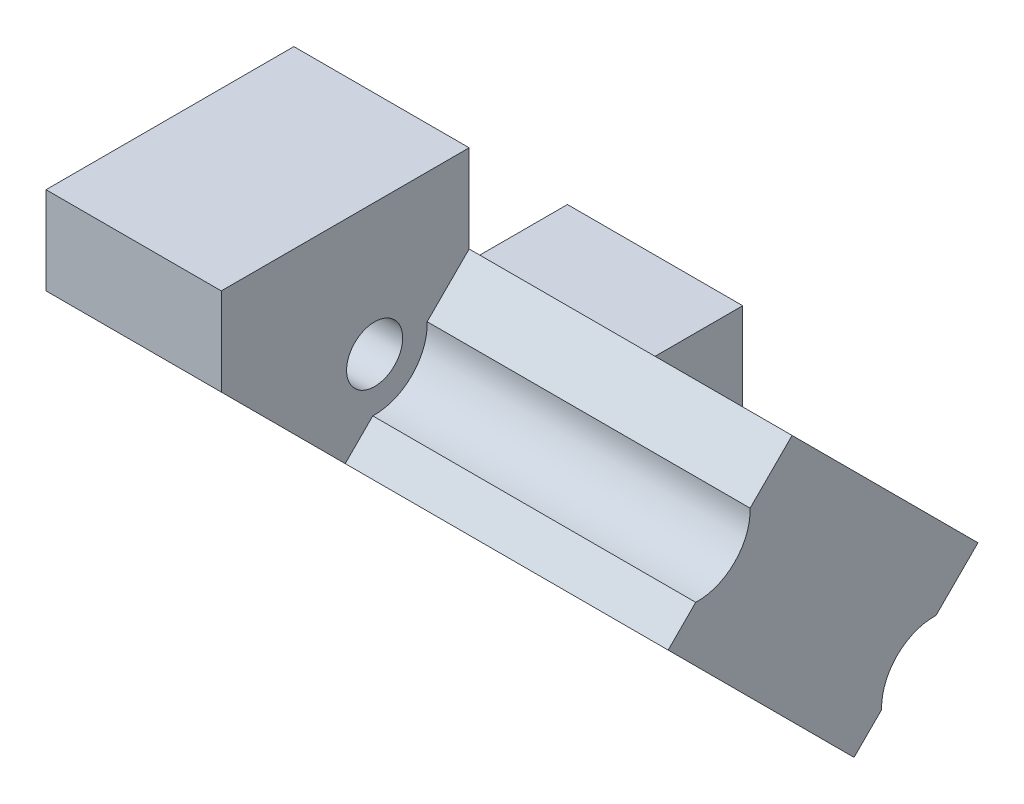
ISO-10303-21;
HEADER;
FILE_DESCRIPTION(('STEP AP214'),'2;1');
FILE_NAME('part.step','',(''),(''),'','','');
FILE_SCHEMA(('AUTOMOTIVE_DESIGN { 1 0 10303 214 1 1 1 1 }'));
ENDSEC;
DATA;
#1=APPLICATION_CONTEXT('core data for automotive mechanical design processes');
#2=APPLICATION_PROTOCOL_DEFINITION('international standard','automotive_design',2000,#1);
#3=PRODUCT_CONTEXT('',#1,'mechanical');
#4=PRODUCT('Part','Part','',(#3));
#5=PRODUCT_RELATED_PRODUCT_CATEGORY('part','',(#4));
#6=PRODUCT_DEFINITION_FORMATION('','',#4);
#7=PRODUCT_DEFINITION_CONTEXT('part definition',#1,'design');
#8=PRODUCT_DEFINITION('design','',#6,#7);
#9=PRODUCT_DEFINITION_SHAPE('','',#8);
#10=(LENGTH_UNIT() NAMED_UNIT(*) SI_UNIT(.MILLI.,.METRE.));
#11=(NAMED_UNIT(*) PLANE_ANGLE_UNIT() SI_UNIT($,.RADIAN.));
#12=(NAMED_UNIT(*) SI_UNIT($,.STERADIAN.) SOLID_ANGLE_UNIT());
#13=UNCERTAINTY_MEASURE_WITH_UNIT(LENGTH_MEASURE(1.E-05),#10,'distance_accuracy_value','');
#14=(GEOMETRIC_REPRESENTATION_CONTEXT(3) GLOBAL_UNCERTAINTY_ASSIGNED_CONTEXT((#13)) GLOBAL_UNIT_ASSIGNED_CONTEXT((#10,
#11,#12)) REPRESENTATION_CONTEXT('',''));
#15=CARTESIAN_POINT('',(0.,0.,0.));
#16=DIRECTION('',(0.,0.,1.));
#17=DIRECTION('',(1.,0.,0.));
#18=AXIS2_PLACEMENT_3D('',#15,#16,#17);
#19=CARTESIAN_POINT('',(-149.080786775194,-340.083953851921,525.27503979709));
#20=DIRECTION('',(0.,-0.707106781186548,0.707106781186547));
#21=DIRECTION('',(1.,0.,0.));
#22=AXIS2_PLACEMENT_3D('',#19,#20,#21);
#23=CONICAL_SURFACE('',#22,2.625,0.785398163397448);
#24=CARTESIAN_POINT('',(-149.080786775194,-339.11168202779,524.302767972959));
#25=DIRECTION('',(0.,-0.707106781186548,0.707106781186547));
#26=DIRECTION('',(-1.,0.,0.));
#27=AXIS2_PLACEMENT_3D('',#24,#25,#26);
#28=CIRCLE('',#27,1.25);
#29=CARTESIAN_POINT('',(-147.830786775194,-339.11168202779,524.302767972959));
#30=VERTEX_POINT('',#29);
#31=CARTESIAN_POINT('',(-150.330786775194,-339.11168202779,524.302767972959));
#32=VERTEX_POINT('',#31);
#33=EDGE_CURVE('E27',#30,#32,#28,.T.);
#34=ORIENTED_EDGE('',*,*,#33,.F.);
#35=CARTESIAN_POINT('',(-149.080786775194,-339.11168202779,524.302767972959));
#36=DIRECTION('',(0.,-0.707106781186548,0.707106781186547));
#37=DIRECTION('',(-1.,0.,0.));
#38=AXIS2_PLACEMENT_3D('',#35,#36,#37);
#39=CIRCLE('',#38,1.25);
#40=EDGE_CURVE('E381',#32,#30,#39,.T.);
#41=ORIENTED_EDGE('',*,*,#40,.F.);
#42=DIRECTION('',(-0.707106781186527,-0.499999999999999,0.50000000000003));
#43=VECTOR('',#42,1.);
#44=CARTESIAN_POINT('',(-151.705786775194,-340.083953851921,525.27503979709));
#45=LINE('',#44,#43);
#46=CARTESIAN_POINT('',(-153.080786775194,-341.056225676053,526.247311621222));
#47=VERTEX_POINT('',#46);
#48=EDGE_CURVE('E11',#32,#47,#45,.T.);
#49=ORIENTED_EDGE('',*,*,#48,.T.);
#50=CARTESIAN_POINT('',(-149.080786775194,-341.056225676053,526.247311621222));
#51=DIRECTION('',(0.,0.707106781186548,-0.707106781186547));
#52=DIRECTION('',(1.,0.,0.));
#53=AXIS2_PLACEMENT_3D('',#50,#51,#52);
#54=CIRCLE('',#53,4.);
#55=CARTESIAN_POINT('',(-145.080786775194,-341.056225676053,526.247311621221));
#56=VERTEX_POINT('',#55);
#57=EDGE_CURVE('E373',#56,#47,#54,.T.);
#58=ORIENTED_EDGE('',*,*,#57,.F.);
#59=CARTESIAN_POINT('',(-149.080786775194,-341.056225676053,526.247311621222));
#60=DIRECTION('',(0.,0.707106781186548,-0.707106781186547));
#61=DIRECTION('',(1.,0.,0.));
#62=AXIS2_PLACEMENT_3D('',#59,#60,#61);
#63=CIRCLE('',#62,4.);
#64=EDGE_CURVE('E377',#47,#56,#63,.T.);
#65=ORIENTED_EDGE('',*,*,#64,.F.);
#66=ORIENTED_EDGE('',*,*,#48,.F.);
#67=EDGE_LOOP('',(#34,#41,#49,#58,#65,#66));
#68=FACE_BOUND('',#67,.T.);
#69=ADVANCED_FACE('F16',(#68),#23,.F.);
#70=CARTESIAN_POINT('',(-149.080786775194,-337.52069177012,522.711777715289));
#71=DIRECTION('',(0.,-0.707106781186548,0.707106781186547));
#72=DIRECTION('',(1.,0.,0.));
#73=AXIS2_PLACEMENT_3D('',#70,#71,#72);
#74=CYLINDRICAL_SURFACE('',#73,1.25);
#75=CARTESIAN_POINT('',(-149.080786775194,-335.92970151245,521.120787457619));
#76=DIRECTION('',(0.,-0.707106781186548,0.707106781186547));
#77=DIRECTION('',(-1.,0.,0.));
#78=AXIS2_PLACEMENT_3D('',#75,#76,#77);
#79=CIRCLE('',#78,1.25);
#80=CARTESIAN_POINT('',(-147.830786775194,-335.92970151245,521.120787457619));
#81=VERTEX_POINT('',#80);
#82=CARTESIAN_POINT('',(-150.330786775194,-335.92970151245,521.120787457619));
#83=VERTEX_POINT('',#82);
#84=EDGE_CURVE('E348',#81,#83,#79,.T.);
#85=ORIENTED_EDGE('',*,*,#84,.F.);
#86=CARTESIAN_POINT('',(-149.080786775194,-335.92970151245,521.120787457619));
#87=DIRECTION('',(0.,-0.707106781186548,0.707106781186547));
#88=DIRECTION('',(-1.,0.,0.));
#89=AXIS2_PLACEMENT_3D('',#86,#87,#88);
#90=CIRCLE('',#89,1.25);
#91=EDGE_CURVE('E352',#83,#81,#90,.T.);
#92=ORIENTED_EDGE('',*,*,#91,.F.);
#93=DIRECTION('',(0.,-0.707106781186548,0.707106781186547));
#94=VECTOR('',#93,1.);
#95=CARTESIAN_POINT('',(-150.330786775194,-337.52069177012,522.711777715289));
#96=LINE('',#95,#94);
#97=EDGE_CURVE('E351',#83,#32,#96,.T.);
#98=ORIENTED_EDGE('',*,*,#97,.T.);
#99=ORIENTED_EDGE('',*,*,#40,.T.);
#100=ORIENTED_EDGE('',*,*,#33,.T.);
#101=ORIENTED_EDGE('',*,*,#97,.F.);
#102=EDGE_LOOP('',(#85,#92,#98,#99,#100,#101));
#103=FACE_BOUND('',#102,.T.);
#104=ADVANCED_FACE('F622',(#103),#74,.F.);
#105=CARTESIAN_POINT('',(-149.080786775194,-334.957429688319,520.148515633488));
#106=DIRECTION('',(0.,0.707106781186548,-0.707106781186547));
#107=DIRECTION('',(1.,0.,0.));
#108=AXIS2_PLACEMENT_3D('',#105,#106,#107);
#109=CONICAL_SURFACE('',#108,2.625,0.785398163397448);
#110=CARTESIAN_POINT('',(-149.080786775194,-333.985157864187,519.176243809356));
#111=DIRECTION('',(0.,-0.707106781186548,0.707106781186547));
#112=DIRECTION('',(1.,0.,0.));
#113=AXIS2_PLACEMENT_3D('',#110,#111,#112);
#114=CIRCLE('',#113,4.);
#115=CARTESIAN_POINT('',(-145.080786775194,-333.985157864187,519.176243809356));
#116=VERTEX_POINT('',#115);
#117=CARTESIAN_POINT('',(-153.080786775194,-333.985157864187,519.176243809356));
#118=VERTEX_POINT('',#117);
#119=EDGE_CURVE('E293',#116,#118,#114,.T.);
#120=ORIENTED_EDGE('',*,*,#119,.F.);
#121=CARTESIAN_POINT('',(-149.080786775194,-333.985157864187,519.176243809356));
#122=DIRECTION('',(0.,-0.707106781186548,0.707106781186547));
#123=DIRECTION('',(1.,0.,0.));
#124=AXIS2_PLACEMENT_3D('',#121,#122,#123);
#125=CIRCLE('',#124,4.);
#126=EDGE_CURVE('E287',#118,#116,#125,.T.);
#127=ORIENTED_EDGE('',*,*,#126,.F.);
#128=DIRECTION('',(0.707106781186567,-0.500000000000003,0.49999999999997));
#129=VECTOR('',#128,1.);
#130=CARTESIAN_POINT('',(-151.705786775194,-334.957429688319,520.148515633488));
#131=LINE('',#130,#129);
#132=EDGE_CURVE('E443',#118,#83,#131,.T.);
#133=ORIENTED_EDGE('',*,*,#132,.T.);
#134=ORIENTED_EDGE('',*,*,#91,.T.);
#135=ORIENTED_EDGE('',*,*,#84,.T.);
#136=ORIENTED_EDGE('',*,*,#132,.F.);
#137=EDGE_LOOP('',(#120,#127,#133,#134,#135,#136));
#138=FACE_BOUND('',#137,.T.);
#139=ADVANCED_FACE('F626',(#138),#109,.F.);
#140=CARTESIAN_POINT('',(-161.504786775194,-342.554127840182,527.745213785352));
#141=DIRECTION('',(1.,0.,0.));
#142=DIRECTION('',(0.,-0.707106781186548,0.707106781186547));
#143=AXIS2_PLACEMENT_3D('',#140,#141,#142);
#144=PLANE('',#143);
#145=CARTESIAN_POINT('',(-161.504786775194,-331.181857005288,529.872942950458));
#146=DIRECTION('',(-1.,0.,0.));
#147=DIRECTION('',(0.,0.707106781186547,0.707106781186548));
#148=AXIS2_PLACEMENT_3D('',#145,#146,#147);
#149=CIRCLE('',#148,1.6);
#150=CARTESIAN_POINT('',(-161.504786775193,-330.05048615539,531.004313800356));
#151=VERTEX_POINT('',#150);
#152=CARTESIAN_POINT('',(-161.504786775194,-332.313227855187,528.741572100559));
#153=VERTEX_POINT('',#152);
#154=EDGE_CURVE('E347',#151,#153,#149,.T.);
#155=ORIENTED_EDGE('',*,*,#154,.T.);
#156=CARTESIAN_POINT('',(-161.504786775194,-331.181857005288,529.872942950458));
#157=DIRECTION('',(-1.,0.,0.));
#158=DIRECTION('',(0.,0.707106781186547,0.707106781186548));
#159=AXIS2_PLACEMENT_3D('',#156,#157,#158);
#160=CIRCLE('',#159,1.6);
#161=EDGE_CURVE('E399',#153,#151,#160,.T.);
#162=ORIENTED_EDGE('',*,*,#161,.T.);
#163=EDGE_LOOP('',(#155,#162));
#164=FACE_BOUND('',#163,.T.);
#165=DIRECTION('',(0.,-0.707106781186547,-0.707106781186548));
#166=VECTOR('',#165,1.);
#167=CARTESIAN_POINT('',(-161.504786775193,-329.025907990247,538.277629307028));
#168=LINE('',#167,#166);
#169=CARTESIAN_POINT('',(-161.504786775193,-328.681857005288,538.621680291987));
#170=VERTEX_POINT('',#169);
#171=CARTESIAN_POINT('',(-161.504786775193,-335.752924817154,531.550612480121));
#172=VERTEX_POINT('',#171);
#173=EDGE_CURVE('E152',#170,#172,#168,.T.);
#174=ORIENTED_EDGE('',*,*,#173,.T.);
#175=DIRECTION('',(0.,-0.707106781186548,0.707106781186547));
#176=VECTOR('',#175,1.);
#177=CARTESIAN_POINT('',(-161.504786775194,-332.966341993286,528.764029656253));
#178=LINE('',#177,#176);
#179=CARTESIAN_POINT('',(-161.504786775194,-334.180026930883,529.977714593851));
#180=VERTEX_POINT('',#179);
#181=EDGE_CURVE('E392',#180,#172,#178,.T.);
#182=ORIENTED_EDGE('',*,*,#181,.F.);
#183=CARTESIAN_POINT('',(-161.504786775194,-331.181857005288,529.872942950458));
#184=DIRECTION('',(-1.,0.,0.));
#185=DIRECTION('',(0.,-0.707106781186547,-0.707106781186548));
#186=AXIS2_PLACEMENT_3D('',#183,#184,#185);
#187=CIRCLE('',#186,3.);
#188=CARTESIAN_POINT('',(-161.504786775194,-331.077085361895,526.874773024863));
#189=VERTEX_POINT('',#188);
#190=EDGE_CURVE('E323',#189,#180,#187,.T.);
#191=ORIENTED_EDGE('',*,*,#190,.F.);
#192=DIRECTION('',(0.,-0.707106781186548,0.707106781186547));
#193=VECTOR('',#192,1.);
#194=CARTESIAN_POINT('',(-161.504786775194,-332.966341993286,528.764029656253));
#195=LINE('',#194,#193);
#196=CARTESIAN_POINT('',(-161.504786775194,-328.681857005288,524.479544668256));
#197=VERTEX_POINT('',#196);
#198=EDGE_CURVE('E427',#197,#189,#195,.T.);
#199=ORIENTED_EDGE('',*,*,#198,.F.);
#200=DIRECTION('',(0.,1.,0.));
#201=VECTOR('',#200,1.);
#202=CARTESIAN_POINT('',(-161.504786775194,-328.681857005288,524.479544668256));
#203=LINE('',#202,#201);
#204=CARTESIAN_POINT('',(-161.504786775194,-323.681857005288,524.479544668256));
#205=VERTEX_POINT('',#204);
#206=EDGE_CURVE('E272',#197,#205,#203,.T.);
#207=ORIENTED_EDGE('',*,*,#206,.T.);
#208=DIRECTION('',(0.,0.,1.));
#209=VECTOR('',#208,1.);
#210=CARTESIAN_POINT('',(-161.504786775194,-323.681857005288,524.479544668256));
#211=LINE('',#210,#209);
#212=CARTESIAN_POINT('',(-161.504786775193,-323.681857005288,538.621680291987));
#213=VERTEX_POINT('',#212);
#214=EDGE_CURVE('E306',#205,#213,#211,.T.);
#215=ORIENTED_EDGE('',*,*,#214,.T.);
#216=DIRECTION('',(0.,-1.,0.));
#217=VECTOR('',#216,1.);
#218=CARTESIAN_POINT('',(-161.504786775193,-323.681857005288,538.621680291987));
#219=LINE('',#218,#217);
#220=EDGE_CURVE('E307',#213,#170,#219,.T.);
#221=ORIENTED_EDGE('',*,*,#220,.T.);
#222=EDGE_LOOP('',(#174,#182,#191,#199,#207,#215,#221));
#223=FACE_BOUND('',#222,.T.);
#224=ADVANCED_FACE('F577',(#164,#223),#144,.T.);
#225=CARTESIAN_POINT('',(-165.504786775194,-328.681857005288,524.479544668256));
#226=DIRECTION('',(-1.,0.,0.));
#227=DIRECTION('',(0.,-0.707106781186547,-0.707106781186548));
#228=AXIS2_PLACEMENT_3D('',#225,#226,#227);
#229=PLANE('',#228);
#230=CARTESIAN_POINT('',(-165.504786775194,-331.181857005288,529.872942950458));
#231=DIRECTION('',(1.,0.,0.));
#232=DIRECTION('',(0.,0.707106781186547,0.707106781186548));
#233=AXIS2_PLACEMENT_3D('',#230,#231,#232);
#234=CIRCLE('',#233,1.6);
#235=CARTESIAN_POINT('',(-165.504786775194,-332.313227855187,528.741572100559));
#236=VERTEX_POINT('',#235);
#237=EDGE_CURVE('E419',#236,#236,#234,.T.);
#238=ORIENTED_EDGE('',*,*,#237,.T.);
#239=EDGE_LOOP('',(#238));
#240=FACE_BOUND('',#239,.T.);
#241=CARTESIAN_POINT('',(-165.504786775194,-344.681857005288,516.372942950458));
#242=DIRECTION('',(1.,0.,0.));
#243=DIRECTION('',(0.,0.707106781186547,0.707106781186548));
#244=AXIS2_PLACEMENT_3D('',#241,#242,#243);
#245=CIRCLE('',#244,1.6);
#246=CARTESIAN_POINT('',(-165.504786775194,-345.813227855187,515.241572100559));
#247=VERTEX_POINT('',#246);
#248=EDGE_CURVE('E344',#247,#247,#245,.T.);
#249=ORIENTED_EDGE('',*,*,#248,.T.);
#250=EDGE_LOOP('',(#249));
#251=FACE_BOUND('',#250,.T.);
#252=DIRECTION('',(0.,0.707106781186547,0.707106781186548));
#253=VECTOR('',#252,1.);
#254=CARTESIAN_POINT('',(-165.504786775193,-326.374257560798,540.929279736477));
#255=LINE('',#254,#253);
#256=CARTESIAN_POINT('',(-165.504786775194,-353.430594346817,513.872942950458));
#257=VERTEX_POINT('',#256);
#258=CARTESIAN_POINT('',(-165.504786775193,-328.681857005288,538.621680291987));
#259=VERTEX_POINT('',#258);
#260=EDGE_CURVE('E254',#257,#259,#255,.T.);
#261=ORIENTED_EDGE('',*,*,#260,.T.);
#262=DIRECTION('',(0.,0.,-1.));
#263=VECTOR('',#262,1.);
#264=CARTESIAN_POINT('',(-165.504786775193,-328.681857005288,539.479544668256));
#265=LINE('',#264,#263);
#266=CARTESIAN_POINT('',(-165.504786775194,-328.681857005288,524.479544668256));
#267=VERTEX_POINT('',#266);
#268=EDGE_CURVE('E258',#259,#267,#265,.T.);
#269=ORIENTED_EDGE('',*,*,#268,.T.);
#270=DIRECTION('',(0.,0.707106781186547,0.707106781186548));
#271=VECTOR('',#270,1.);
#272=CARTESIAN_POINT('',(-165.504786775194,-339.288458723086,513.872942950458));
#273=LINE('',#272,#271);
#274=CARTESIAN_POINT('',(-165.504786775194,-339.288458723086,513.872942950458));
#275=VERTEX_POINT('',#274);
#276=EDGE_CURVE('E354',#275,#267,#273,.T.);
#277=ORIENTED_EDGE('',*,*,#276,.F.);
#278=DIRECTION('',(0.,-1.,0.));
#279=VECTOR('',#278,1.);
#280=CARTESIAN_POINT('',(-165.504786775194,-339.288458723086,513.872942950458));
#281=LINE('',#280,#279);
#282=EDGE_CURVE('E261',#275,#257,#281,.T.);
#283=ORIENTED_EDGE('',*,*,#282,.T.);
#284=EDGE_LOOP('',(#261,#269,#277,#283));
#285=FACE_BOUND('',#284,.T.);
#286=ADVANCED_FACE('F255',(#240,#251,#285),#229,.T.);
#287=CARTESIAN_POINT('',(-216.603281805474,-331.181857005288,529.87294295046));
#288=DIRECTION('',(1.,0.,0.));
#289=DIRECTION('',(0.,0.707106781186547,0.707106781186548));
#290=AXIS2_PLACEMENT_3D('',#287,#288,#289);
#291=CYLINDRICAL_SURFACE('',#290,1.6);
#292=ORIENTED_EDGE('',*,*,#154,.F.);
#293=ORIENTED_EDGE('',*,*,#161,.F.);
#294=DIRECTION('',(-1.,0.,0.));
#295=VECTOR('',#294,1.);
#296=CARTESIAN_POINT('',(-216.603281805474,-332.313227855186,528.741572100561));
#297=LINE('',#296,#295);
#298=EDGE_CURVE('E402',#153,#236,#297,.T.);
#299=ORIENTED_EDGE('',*,*,#298,.T.);
#300=ORIENTED_EDGE('',*,*,#237,.F.);
#301=ORIENTED_EDGE('',*,*,#298,.F.);
#302=EDGE_LOOP('',(#292,#293,#299,#300,#301));
#303=FACE_BOUND('',#302,.T.);
#304=ADVANCED_FACE('F652',(#303),#291,.F.);
#305=CARTESIAN_POINT('',(-216.603281805475,-344.681857005288,516.37294295046));
#306=DIRECTION('',(1.,0.,0.));
#307=DIRECTION('',(0.,0.707106781186547,0.707106781186548));
#308=AXIS2_PLACEMENT_3D('',#305,#306,#307);
#309=CYLINDRICAL_SURFACE('',#308,1.6);
#310=CARTESIAN_POINT('',(-161.504786775194,-344.681857005288,516.372942950458));
#311=DIRECTION('',(-1.,0.,0.));
#312=DIRECTION('',(0.,0.707106781186547,0.707106781186548));
#313=AXIS2_PLACEMENT_3D('',#310,#311,#312);
#314=CIRCLE('',#313,1.6);
#315=CARTESIAN_POINT('',(-161.504786775194,-343.55048615539,517.504313800356));
#316=VERTEX_POINT('',#315);
#317=CARTESIAN_POINT('',(-161.504786775194,-345.813227855187,515.241572100559));
#318=VERTEX_POINT('',#317);
#319=EDGE_CURVE('E498',#316,#318,#314,.T.);
#320=ORIENTED_EDGE('',*,*,#319,.F.);
#321=CARTESIAN_POINT('',(-161.504786775194,-344.681857005288,516.372942950458));
#322=DIRECTION('',(-1.,0.,0.));
#323=DIRECTION('',(0.,0.707106781186547,0.707106781186548));
#324=AXIS2_PLACEMENT_3D('',#321,#322,#323);
#325=CIRCLE('',#324,1.6);
#326=EDGE_CURVE('E430',#318,#316,#325,.T.);
#327=ORIENTED_EDGE('',*,*,#326,.F.);
#328=DIRECTION('',(-1.,0.,0.));
#329=VECTOR('',#328,1.);
#330=CARTESIAN_POINT('',(-216.603281805475,-345.813227855186,515.241572100561));
#331=LINE('',#330,#329);
#332=EDGE_CURVE('E20',#318,#247,#331,.T.);
#333=ORIENTED_EDGE('',*,*,#332,.T.);
#334=ORIENTED_EDGE('',*,*,#248,.F.);
#335=ORIENTED_EDGE('',*,*,#332,.F.);
#336=EDGE_LOOP('',(#320,#327,#333,#334,#335));
#337=FACE_BOUND('',#336,.T.);
#338=ADVANCED_FACE('F649',(#337),#309,.F.);
#339=CARTESIAN_POINT('',(-135.504786775194,-328.681857005288,524.479544668255));
#340=DIRECTION('',(0.,0.707106781186547,0.707106781186548));
#341=DIRECTION('',(-1.,0.,0.));
#342=AXIS2_PLACEMENT_3D('',#339,#340,#341);
#343=PLANE('',#342);
#344=DIRECTION('',(0.,0.707106781186548,-0.707106781186547));
#345=VECTOR('',#344,1.);
#346=CARTESIAN_POINT('',(-143.080786775194,-332.217390911221,528.015078574188));
#347=LINE('',#346,#345);
#348=CARTESIAN_POINT('',(-143.080786775194,-331.077085361895,526.874773024862));
#349=VERTEX_POINT('',#348);
#350=CARTESIAN_POINT('',(-143.080786775194,-328.681857005288,524.479544668255));
#351=VERTEX_POINT('',#350);
#352=EDGE_CURVE('E335',#349,#351,#347,.T.);
#353=ORIENTED_EDGE('',*,*,#352,.T.);
#354=DIRECTION('',(1.,0.,0.));
#355=VECTOR('',#354,1.);
#356=CARTESIAN_POINT('',(-165.504786775194,-328.681857005288,524.479544668256));
#357=LINE('',#356,#355);
#358=EDGE_CURVE('E385',#197,#351,#357,.T.);
#359=ORIENTED_EDGE('',*,*,#358,.F.);
#360=ORIENTED_EDGE('',*,*,#198,.T.);
#361=DIRECTION('',(1.,0.,0.));
#362=VECTOR('',#361,1.);
#363=CARTESIAN_POINT('',(-135.504786775194,-331.077085361895,526.874773024862));
#364=LINE('',#363,#362);
#365=EDGE_CURVE('E328',#189,#349,#364,.T.);
#366=ORIENTED_EDGE('',*,*,#365,.T.);
#367=EDGE_LOOP('',(#353,#359,#360,#366));
#368=FACE_BOUND('',#367,.T.);
#369=ADVANCED_FACE('F559',(#368),#343,.T.);
#370=CARTESIAN_POINT('',(-161.504786775194,-342.554127840182,527.745213785352));
#371=DIRECTION('',(1.,0.,0.));
#372=DIRECTION('',(0.,-0.707106781186548,0.707106781186547));
#373=AXIS2_PLACEMENT_3D('',#370,#371,#372);
#374=PLANE('',#373);
#375=ORIENTED_EDGE('',*,*,#319,.T.);
#376=ORIENTED_EDGE('',*,*,#326,.T.);
#377=EDGE_LOOP('',(#375,#376));
#378=FACE_BOUND('',#377,.T.);
#379=DIRECTION('',(0.,0.707106781186548,-0.707106781186547));
#380=VECTOR('',#379,1.);
#381=CARTESIAN_POINT('',(-161.504786775194,-343.572943711084,518.157427938455));
#382=LINE('',#381,#380);
#383=CARTESIAN_POINT('',(-161.504786775194,-341.683687079693,516.268171307065));
#384=VERTEX_POINT('',#383);
#385=CARTESIAN_POINT('',(-161.504786775194,-339.288458723086,513.872942950458));
#386=VERTEX_POINT('',#385);
#387=EDGE_CURVE('E327',#384,#386,#382,.T.);
#388=ORIENTED_EDGE('',*,*,#387,.F.);
#389=CARTESIAN_POINT('',(-161.504786775194,-344.681857005288,516.372942950458));
#390=DIRECTION('',(-1.,0.,0.));
#391=DIRECTION('',(0.,-0.707106781186547,-0.707106781186548));
#392=AXIS2_PLACEMENT_3D('',#389,#390,#391);
#393=CIRCLE('',#392,3.);
#394=CARTESIAN_POINT('',(-161.504786775194,-344.786628648681,519.371112876052));
#395=VERTEX_POINT('',#394);
#396=EDGE_CURVE('E527',#395,#384,#393,.T.);
#397=ORIENTED_EDGE('',*,*,#396,.F.);
#398=DIRECTION('',(0.,0.707106781186548,-0.707106781186547));
#399=VECTOR('',#398,1.);
#400=CARTESIAN_POINT('',(-161.504786775194,-343.572943711084,518.157427938455));
#401=LINE('',#400,#399);
#402=CARTESIAN_POINT('',(-161.504786775194,-346.359526534952,520.944010762323));
#403=VERTEX_POINT('',#402);
#404=EDGE_CURVE('E365',#403,#395,#401,.T.);
#405=ORIENTED_EDGE('',*,*,#404,.F.);
#406=DIRECTION('',(0.,-0.707106781186547,-0.707106781186548));
#407=VECTOR('',#406,1.);
#408=CARTESIAN_POINT('',(-161.504786775193,-329.025907990247,538.277629307028));
#409=LINE('',#408,#407);
#410=CARTESIAN_POINT('',(-161.504786775194,-353.430594346817,513.872942950458));
#411=VERTEX_POINT('',#410);
#412=EDGE_CURVE('E265',#403,#411,#409,.T.);
#413=ORIENTED_EDGE('',*,*,#412,.T.);
#414=DIRECTION('',(0.,0.,-1.));
#415=VECTOR('',#414,1.);
#416=CARTESIAN_POINT('',(-161.504786775194,-353.430594346817,513.872942950458));
#417=LINE('',#416,#415);
#418=CARTESIAN_POINT('',(-161.504786775194,-353.430594346817,508.872942950458));
#419=VERTEX_POINT('',#418);
#420=EDGE_CURVE('E333',#411,#419,#417,.T.);
#421=ORIENTED_EDGE('',*,*,#420,.T.);
#422=DIRECTION('',(0.,1.,0.));
#423=VECTOR('',#422,1.);
#424=CARTESIAN_POINT('',(-161.504786775194,-353.430594346817,508.872942950458));
#425=LINE('',#424,#423);
#426=CARTESIAN_POINT('',(-161.504786775194,-339.288458723086,508.872942950458));
#427=VERTEX_POINT('',#426);
#428=EDGE_CURVE('E321',#419,#427,#425,.T.);
#429=ORIENTED_EDGE('',*,*,#428,.T.);
#430=DIRECTION('',(0.,0.,1.));
#431=VECTOR('',#430,1.);
#432=CARTESIAN_POINT('',(-161.504786775194,-339.288458723086,508.872942950458));
#433=LINE('',#432,#431);
#434=EDGE_CURVE('E371',#427,#386,#433,.T.);
#435=ORIENTED_EDGE('',*,*,#434,.T.);
#436=EDGE_LOOP('',(#388,#397,#405,#413,#421,#429,#435));
#437=FACE_BOUND('',#436,.T.);
#438=ADVANCED_FACE('F591',(#378,#437),#374,.T.);
#439=CARTESIAN_POINT('',(-165.504786775194,-339.288458723086,513.872942950458));
#440=DIRECTION('',(0.,-0.707106781186547,-0.707106781186548));
#441=DIRECTION('',(0.,0.707106781186548,-0.707106781186547));
#442=AXIS2_PLACEMENT_3D('',#439,#440,#441);
#443=PLANE('',#442);
#444=DIRECTION('',(0.,-0.707106781186548,0.707106781186547));
#445=VECTOR('',#444,1.);
#446=CARTESIAN_POINT('',(-143.080786775194,-342.823992629019,517.40847685639));
#447=LINE('',#446,#445);
#448=CARTESIAN_POINT('',(-143.080786775194,-339.288458723086,513.872942950457));
#449=VERTEX_POINT('',#448);
#450=CARTESIAN_POINT('',(-143.080786775194,-341.683687079693,516.268171307064));
#451=VERTEX_POINT('',#450);
#452=EDGE_CURVE('E339',#449,#451,#447,.T.);
#453=ORIENTED_EDGE('',*,*,#452,.T.);
#454=DIRECTION('',(-1.,0.,0.));
#455=VECTOR('',#454,1.);
#456=CARTESIAN_POINT('',(-135.504786775194,-341.683687079693,516.268171307064));
#457=LINE('',#456,#455);
#458=EDGE_CURVE('E366',#451,#384,#457,.T.);
#459=ORIENTED_EDGE('',*,*,#458,.T.);
#460=ORIENTED_EDGE('',*,*,#387,.T.);
#461=DIRECTION('',(-1.,0.,0.));
#462=VECTOR('',#461,1.);
#463=CARTESIAN_POINT('',(-135.504786775194,-339.288458723086,513.872942950456));
#464=LINE('',#463,#462);
#465=EDGE_CURVE('E311',#449,#386,#464,.T.);
#466=ORIENTED_EDGE('',*,*,#465,.F.);
#467=EDGE_LOOP('',(#453,#459,#460,#466));
#468=FACE_BOUND('',#467,.T.);
#469=ADVANCED_FACE('F588',(#468),#443,.T.);
#470=CARTESIAN_POINT('',(-135.504786775194,-331.181857005288,529.872942950456));
#471=DIRECTION('',(-1.,0.,0.));
#472=DIRECTION('',(0.,-0.707106781186547,-0.707106781186548));
#473=AXIS2_PLACEMENT_3D('',#470,#471,#472);
#474=CYLINDRICAL_SURFACE('',#473,3.);
#475=CARTESIAN_POINT('',(-143.080786775194,-331.181857005288,529.872942950457));
#476=DIRECTION('',(1.,0.,0.));
#477=DIRECTION('',(0.,-0.707106781186547,-0.707106781186548));
#478=AXIS2_PLACEMENT_3D('',#475,#476,#477);
#479=CIRCLE('',#478,3.);
#480=CARTESIAN_POINT('',(-143.080786775194,-334.180026930883,529.97771459385));
#481=VERTEX_POINT('',#480);
#482=EDGE_CURVE('E338',#481,#349,#479,.T.);
#483=ORIENTED_EDGE('',*,*,#482,.T.);
#484=ORIENTED_EDGE('',*,*,#365,.F.);
#485=ORIENTED_EDGE('',*,*,#190,.T.);
#486=DIRECTION('',(-1.,0.,0.));
#487=VECTOR('',#486,1.);
#488=CARTESIAN_POINT('',(-135.504786775194,-334.180026930883,529.977714593849));
#489=LINE('',#488,#487);
#490=EDGE_CURVE('E388',#481,#180,#489,.T.);
#491=ORIENTED_EDGE('',*,*,#490,.F.);
#492=EDGE_LOOP('',(#483,#484,#485,#491));
#493=FACE_BOUND('',#492,.T.);
#494=ADVANCED_FACE('F576',(#493),#474,.F.);
#495=CARTESIAN_POINT('',(-135.504786775194,-328.681857005288,524.479544668255));
#496=DIRECTION('',(0.,0.707106781186547,0.707106781186548));
#497=DIRECTION('',(-1.,0.,0.));
#498=AXIS2_PLACEMENT_3D('',#495,#496,#497);
#499=PLANE('',#498);
#500=DIRECTION('',(0.,0.707106781186548,-0.707106781186547));
#501=VECTOR('',#500,1.);
#502=CARTESIAN_POINT('',(-143.080786775194,-332.217390911221,528.015078574188));
#503=LINE('',#502,#501);
#504=CARTESIAN_POINT('',(-143.080786775193,-335.752924817154,531.55061248012));
#505=VERTEX_POINT('',#504);
#506=EDGE_CURVE('E398',#505,#481,#503,.T.);
#507=ORIENTED_EDGE('',*,*,#506,.T.);
#508=ORIENTED_EDGE('',*,*,#490,.T.);
#509=ORIENTED_EDGE('',*,*,#181,.T.);
#510=DIRECTION('',(-1.,0.,0.));
#511=VECTOR('',#510,1.);
#512=CARTESIAN_POINT('',(-165.504786775193,-335.752924817154,531.550612480121));
#513=LINE('',#512,#511);
#514=EDGE_CURVE('E469',#505,#172,#513,.T.);
#515=ORIENTED_EDGE('',*,*,#514,.F.);
#516=EDGE_LOOP('',(#507,#508,#509,#515));
#517=FACE_BOUND('',#516,.T.);
#518=ADVANCED_FACE('F579',(#517),#499,.T.);
#519=CARTESIAN_POINT('',(-150.504786775194,-341.056225676053,526.247311621222));
#520=DIRECTION('',(0.,-0.707106781186548,0.707106781186547));
#521=DIRECTION('',(-1.,0.,0.));
#522=AXIS2_PLACEMENT_3D('',#519,#520,#521);
#523=PLANE('',#522);
#524=ORIENTED_EDGE('',*,*,#57,.T.);
#525=ORIENTED_EDGE('',*,*,#64,.T.);
#526=EDGE_LOOP('',(#524,#525));
#527=FACE_BOUND('',#526,.T.);
#528=CARTESIAN_POINT('',(-157.504786775194,-341.056225676053,526.247311621222));
#529=DIRECTION('',(0.,0.707106781186548,-0.707106781186547));
#530=DIRECTION('',(-1.,0.,0.));
#531=AXIS2_PLACEMENT_3D('',#528,#529,#530);
#532=CIRCLE('',#531,0.95);
#533=CARTESIAN_POINT('',(-156.554786775194,-341.056225676053,526.247311621222));
#534=VERTEX_POINT('',#533);
#535=EDGE_CURVE('E343',#534,#534,#532,.T.);
#536=ORIENTED_EDGE('',*,*,#535,.T.);
#537=EDGE_LOOP('',(#536));
#538=FACE_BOUND('',#537,.T.);
#539=DIRECTION('',(0.,0.707106781186547,0.707106781186548));
#540=VECTOR('',#539,1.);
#541=CARTESIAN_POINT('',(-143.080786775194,-345.439361771408,521.864175525866));
#542=LINE('',#541,#540);
#543=CARTESIAN_POINT('',(-143.080786775194,-346.359526534952,520.944010762322));
#544=VERTEX_POINT('',#543);
#545=EDGE_CURVE('E475',#544,#505,#542,.T.);
#546=ORIENTED_EDGE('',*,*,#545,.T.);
#547=ORIENTED_EDGE('',*,*,#514,.T.);
#548=ORIENTED_EDGE('',*,*,#173,.F.);
#549=DIRECTION('',(1.,0.,0.));
#550=VECTOR('',#549,1.);
#551=CARTESIAN_POINT('',(-163.504786775193,-328.681857005288,538.621680291987));
#552=LINE('',#551,#550);
#553=EDGE_CURVE('E267',#259,#170,#552,.T.);
#554=ORIENTED_EDGE('',*,*,#553,.F.);
#555=ORIENTED_EDGE('',*,*,#260,.F.);
#556=DIRECTION('',(-1.,0.,0.));
#557=VECTOR('',#556,1.);
#558=CARTESIAN_POINT('',(-163.504786775194,-353.430594346817,513.872942950458));
#559=LINE('',#558,#557);
#560=EDGE_CURVE('E411',#411,#257,#559,.T.);
#561=ORIENTED_EDGE('',*,*,#560,.F.);
#562=ORIENTED_EDGE('',*,*,#412,.F.);
#563=DIRECTION('',(1.,0.,0.));
#564=VECTOR('',#563,1.);
#565=CARTESIAN_POINT('',(-160.504786775194,-346.359526534952,520.944010762323));
#566=LINE('',#565,#564);
#567=EDGE_CURVE('E362',#403,#544,#566,.T.);
#568=ORIENTED_EDGE('',*,*,#567,.T.);
#569=EDGE_LOOP('',(#546,#547,#548,#554,#555,#561,#562,#568));
#570=FACE_BOUND('',#569,.T.);
#571=ADVANCED_FACE('F269',(#527,#538,#570),#523,.T.);
#572=CARTESIAN_POINT('',(-165.504786775194,-339.288458723086,513.872942950458));
#573=DIRECTION('',(0.,-0.707106781186547,-0.707106781186548));
#574=DIRECTION('',(0.,0.707106781186548,-0.707106781186547));
#575=AXIS2_PLACEMENT_3D('',#572,#573,#574);
#576=PLANE('',#575);
#577=DIRECTION('',(0.,-0.707106781186548,0.707106781186547));
#578=VECTOR('',#577,1.);
#579=CARTESIAN_POINT('',(-143.080786775194,-342.823992629019,517.40847685639));
#580=LINE('',#579,#578);
#581=CARTESIAN_POINT('',(-143.080786775194,-344.786628648681,519.371112876051));
#582=VERTEX_POINT('',#581);
#583=EDGE_CURVE('E478',#582,#544,#580,.T.);
#584=ORIENTED_EDGE('',*,*,#583,.T.);
#585=ORIENTED_EDGE('',*,*,#567,.F.);
#586=ORIENTED_EDGE('',*,*,#404,.T.);
#587=DIRECTION('',(1.,0.,0.));
#588=VECTOR('',#587,1.);
#589=CARTESIAN_POINT('',(-135.504786775194,-344.786628648681,519.371112876051));
#590=LINE('',#589,#588);
#591=EDGE_CURVE('E485',#395,#582,#590,.T.);
#592=ORIENTED_EDGE('',*,*,#591,.T.);
#593=EDGE_LOOP('',(#584,#585,#586,#592));
#594=FACE_BOUND('',#593,.T.);
#595=ADVANCED_FACE('F606',(#594),#576,.T.);
#596=CARTESIAN_POINT('',(-135.504786775194,-344.681857005288,516.372942950456));
#597=DIRECTION('',(-1.,0.,0.));
#598=DIRECTION('',(0.,0.707106781186547,0.707106781186548));
#599=AXIS2_PLACEMENT_3D('',#596,#597,#598);
#600=CYLINDRICAL_SURFACE('',#599,3.);
#601=CARTESIAN_POINT('',(-143.080786775194,-344.681857005288,516.372942950457));
#602=DIRECTION('',(1.,0.,0.));
#603=DIRECTION('',(0.,-0.707106781186547,-0.707106781186548));
#604=AXIS2_PLACEMENT_3D('',#601,#602,#603);
#605=CIRCLE('',#604,3.);
#606=EDGE_CURVE('E481',#451,#582,#605,.T.);
#607=ORIENTED_EDGE('',*,*,#606,.T.);
#608=ORIENTED_EDGE('',*,*,#591,.F.);
#609=ORIENTED_EDGE('',*,*,#396,.T.);
#610=ORIENTED_EDGE('',*,*,#458,.F.);
#611=EDGE_LOOP('',(#607,#608,#609,#610));
#612=FACE_BOUND('',#611,.T.);
#613=ADVANCED_FACE('F608',(#612),#600,.F.);
#614=CARTESIAN_POINT('',(-143.080786775194,-349.822497866763,517.481039430511));
#615=DIRECTION('',(-1.,0.,0.));
#616=DIRECTION('',(0.,-0.707106781186548,0.707106781186547));
#617=AXIS2_PLACEMENT_3D('',#614,#615,#616);
#618=PLANE('',#617);
#619=ORIENTED_EDGE('',*,*,#452,.F.);
#620=DIRECTION('',(0.,-0.707106781186547,-0.707106781186548));
#621=VECTOR('',#620,1.);
#622=CARTESIAN_POINT('',(-143.080786775194,-338.368293959542,514.793107714001));
#623=LINE('',#622,#621);
#624=EDGE_CURVE('E316',#351,#449,#623,.T.);
#625=ORIENTED_EDGE('',*,*,#624,.F.);
#626=ORIENTED_EDGE('',*,*,#352,.F.);
#627=ORIENTED_EDGE('',*,*,#482,.F.);
#628=ORIENTED_EDGE('',*,*,#506,.F.);
#629=ORIENTED_EDGE('',*,*,#545,.F.);
#630=ORIENTED_EDGE('',*,*,#583,.F.);
#631=ORIENTED_EDGE('',*,*,#606,.F.);
#632=EDGE_LOOP('',(#619,#625,#626,#627,#628,#629,#630,#631));
#633=FACE_BOUND('',#632,.T.);
#634=ADVANCED_FACE('F584',(#633),#618,.F.);
#635=CARTESIAN_POINT('',(-171.504786775194,-346.359526534952,511.372942950458));
#636=DIRECTION('',(-1.,0.,0.));
#637=DIRECTION('',(0.,-0.707106781186547,-0.707106781186548));
#638=AXIS2_PLACEMENT_3D('',#635,#636,#637);
#639=PLANE('',#638);
#640=DIRECTION('',(0.,1.,0.));
#641=VECTOR('',#640,1.);
#642=CARTESIAN_POINT('',(-171.504786775194,-339.288458723086,513.872942950458));
#643=LINE('',#642,#641);
#644=CARTESIAN_POINT('',(-171.504786775194,-353.430594346817,513.872942950458));
#645=VERTEX_POINT('',#644);
#646=CARTESIAN_POINT('',(-171.504786775194,-339.288458723086,513.872942950458));
#647=VERTEX_POINT('',#646);
#648=EDGE_CURVE('E334',#645,#647,#643,.T.);
#649=ORIENTED_EDGE('',*,*,#648,.T.);
#650=DIRECTION('',(0.,0.,-1.));
#651=VECTOR('',#650,1.);
#652=CARTESIAN_POINT('',(-171.504786775194,-339.288458723086,508.872942950458));
#653=LINE('',#652,#651);
#654=CARTESIAN_POINT('',(-171.504786775194,-339.288458723086,508.872942950458));
#655=VERTEX_POINT('',#654);
#656=EDGE_CURVE('E461',#647,#655,#653,.T.);
#657=ORIENTED_EDGE('',*,*,#656,.T.);
#658=DIRECTION('',(0.,-1.,0.));
#659=VECTOR('',#658,1.);
#660=CARTESIAN_POINT('',(-171.504786775194,-353.430594346817,508.872942950458));
#661=LINE('',#660,#659);
#662=CARTESIAN_POINT('',(-171.504786775194,-353.430594346817,508.872942950458));
#663=VERTEX_POINT('',#662);
#664=EDGE_CURVE('E372',#655,#663,#661,.T.);
#665=ORIENTED_EDGE('',*,*,#664,.T.);
#666=DIRECTION('',(0.,0.,1.));
#667=VECTOR('',#666,1.);
#668=CARTESIAN_POINT('',(-171.504786775194,-353.430594346817,513.872942950458));
#669=LINE('',#668,#667);
#670=EDGE_CURVE('E322',#663,#645,#669,.T.);
#671=ORIENTED_EDGE('',*,*,#670,.T.);
#672=EDGE_LOOP('',(#649,#657,#665,#671));
#673=FACE_BOUND('',#672,.T.);
#674=ADVANCED_FACE('F616',(#673),#639,.T.);
#675=CARTESIAN_POINT('',(-161.504786775194,-339.288458723086,513.872942950458));
#676=DIRECTION('',(0.,1.,0.));
#677=DIRECTION('',(1.,0.,0.));
#678=AXIS2_PLACEMENT_3D('',#675,#676,#677);
#679=PLANE('',#678);
#680=ORIENTED_EDGE('',*,*,#434,.F.);
#681=DIRECTION('',(-1.,0.,0.));
#682=VECTOR('',#681,1.);
#683=CARTESIAN_POINT('',(-161.504786775194,-339.288458723086,508.872942950458));
#684=LINE('',#683,#682);
#685=EDGE_CURVE('E367',#427,#655,#684,.T.);
#686=ORIENTED_EDGE('',*,*,#685,.T.);
#687=ORIENTED_EDGE('',*,*,#656,.F.);
#688=DIRECTION('',(-1.,0.,0.));
#689=VECTOR('',#688,1.);
#690=CARTESIAN_POINT('',(-161.504786775194,-339.288458723086,513.872942950458));
#691=LINE('',#690,#689);
#692=EDGE_CURVE('E299',#275,#647,#691,.T.);
#693=ORIENTED_EDGE('',*,*,#692,.F.);
#694=DIRECTION('',(-1.,0.,0.));
#695=VECTOR('',#694,1.);
#696=CARTESIAN_POINT('',(-135.504786775194,-339.288458723086,513.872942950456));
#697=LINE('',#696,#695);
#698=EDGE_CURVE('E315',#386,#275,#697,.T.);
#699=ORIENTED_EDGE('',*,*,#698,.F.);
#700=EDGE_LOOP('',(#680,#686,#687,#693,#699));
#701=FACE_BOUND('',#700,.T.);
#702=ADVANCED_FACE('F594',(#701),#679,.T.);
#703=CARTESIAN_POINT('',(-161.504786775194,-339.288458723086,508.872942950458));
#704=DIRECTION('',(0.,0.,-1.));
#705=DIRECTION('',(0.,1.,0.));
#706=AXIS2_PLACEMENT_3D('',#703,#704,#705);
#707=PLANE('',#706);
#708=ORIENTED_EDGE('',*,*,#428,.F.);
#709=DIRECTION('',(-1.,0.,0.));
#710=VECTOR('',#709,1.);
#711=CARTESIAN_POINT('',(-161.504786775194,-353.430594346817,508.872942950458));
#712=LINE('',#711,#710);
#713=EDGE_CURVE('E317',#419,#663,#712,.T.);
#714=ORIENTED_EDGE('',*,*,#713,.T.);
#715=ORIENTED_EDGE('',*,*,#664,.F.);
#716=ORIENTED_EDGE('',*,*,#685,.F.);
#717=EDGE_LOOP('',(#708,#714,#715,#716));
#718=FACE_BOUND('',#717,.T.);
#719=ADVANCED_FACE('F636',(#718),#707,.T.);
#720=CARTESIAN_POINT('',(-161.504786775194,-353.430594346817,508.872942950458));
#721=DIRECTION('',(0.,-1.,0.));
#722=DIRECTION('',(1.,0.,0.));
#723=AXIS2_PLACEMENT_3D('',#720,#721,#722);
#724=PLANE('',#723);
#725=ORIENTED_EDGE('',*,*,#420,.F.);
#726=ORIENTED_EDGE('',*,*,#560,.T.);
#727=DIRECTION('',(-1.,0.,0.));
#728=VECTOR('',#727,1.);
#729=CARTESIAN_POINT('',(-161.504786775194,-353.430594346817,513.872942950458));
#730=LINE('',#729,#728);
#731=EDGE_CURVE('E329',#257,#645,#730,.T.);
#732=ORIENTED_EDGE('',*,*,#731,.T.);
#733=ORIENTED_EDGE('',*,*,#670,.F.);
#734=ORIENTED_EDGE('',*,*,#713,.F.);
#735=EDGE_LOOP('',(#725,#726,#732,#733,#734));
#736=FACE_BOUND('',#735,.T.);
#737=ADVANCED_FACE('F602',(#736),#724,.T.);
#738=CARTESIAN_POINT('',(-161.504786775194,-353.430594346817,513.872942950458));
#739=DIRECTION('',(0.,0.,1.));
#740=DIRECTION('',(-1.,0.,0.));
#741=AXIS2_PLACEMENT_3D('',#738,#739,#740);
#742=PLANE('',#741);
#743=ORIENTED_EDGE('',*,*,#282,.F.);
#744=ORIENTED_EDGE('',*,*,#692,.T.);
#745=ORIENTED_EDGE('',*,*,#648,.F.);
#746=ORIENTED_EDGE('',*,*,#731,.F.);
#747=EDGE_LOOP('',(#743,#744,#745,#746));
#748=FACE_BOUND('',#747,.T.);
#749=ADVANCED_FACE('F598',(#748),#742,.T.);
#750=CARTESIAN_POINT('',(-171.504786775193,-326.181857005288,531.550612480122));
#751=DIRECTION('',(-1.,0.,0.));
#752=DIRECTION('',(0.,-0.707106781186547,-0.707106781186548));
#753=AXIS2_PLACEMENT_3D('',#750,#751,#752);
#754=PLANE('',#753);
#755=DIRECTION('',(0.,-1.,0.));
#756=VECTOR('',#755,1.);
#757=CARTESIAN_POINT('',(-171.504786775194,-328.681857005288,524.479544668256));
#758=LINE('',#757,#756);
#759=CARTESIAN_POINT('',(-171.504786775194,-323.681857005288,524.479544668256));
#760=VERTEX_POINT('',#759);
#761=CARTESIAN_POINT('',(-171.504786775194,-328.681857005288,524.479544668256));
#762=VERTEX_POINT('',#761);
#763=EDGE_CURVE('E300',#760,#762,#758,.T.);
#764=ORIENTED_EDGE('',*,*,#763,.T.);
#765=DIRECTION('',(0.,0.,1.));
#766=VECTOR('',#765,1.);
#767=CARTESIAN_POINT('',(-171.504786775193,-328.681857005288,538.621680291987));
#768=LINE('',#767,#766);
#769=CARTESIAN_POINT('',(-171.504786775193,-328.681857005288,538.621680291987));
#770=VERTEX_POINT('',#769);
#771=EDGE_CURVE('E280',#762,#770,#768,.T.);
#772=ORIENTED_EDGE('',*,*,#771,.T.);
#773=DIRECTION('',(0.,1.,0.));
#774=VECTOR('',#773,1.);
#775=CARTESIAN_POINT('',(-171.504786775193,-323.681857005288,538.621680291987));
#776=LINE('',#775,#774);
#777=CARTESIAN_POINT('',(-171.504786775193,-323.681857005288,538.621680291987));
#778=VERTEX_POINT('',#777);
#779=EDGE_CURVE('E169',#770,#778,#776,.T.);
#780=ORIENTED_EDGE('',*,*,#779,.T.);
#781=DIRECTION('',(0.,0.,-1.));
#782=VECTOR('',#781,1.);
#783=CARTESIAN_POINT('',(-171.504786775194,-323.681857005288,524.479544668256));
#784=LINE('',#783,#782);
#785=EDGE_CURVE('E305',#778,#760,#784,.T.);
#786=ORIENTED_EDGE('',*,*,#785,.T.);
#787=EDGE_LOOP('',(#764,#772,#780,#786));
#788=FACE_BOUND('',#787,.T.);
#789=ADVANCED_FACE('F550',(#788),#754,.T.);
#790=CARTESIAN_POINT('',(-161.504786775194,-323.681857005288,524.479544668256));
#791=DIRECTION('',(0.,0.,-1.));
#792=DIRECTION('',(0.,-1.,0.));
#793=AXIS2_PLACEMENT_3D('',#790,#791,#792);
#794=PLANE('',#793);
#795=ORIENTED_EDGE('',*,*,#206,.F.);
#796=DIRECTION('',(1.,0.,0.));
#797=VECTOR('',#796,1.);
#798=CARTESIAN_POINT('',(-165.504786775194,-328.681857005288,524.479544668256));
#799=LINE('',#798,#797);
#800=EDGE_CURVE('E358',#267,#197,#799,.T.);
#801=ORIENTED_EDGE('',*,*,#800,.F.);
#802=DIRECTION('',(-1.,0.,0.));
#803=VECTOR('',#802,1.);
#804=CARTESIAN_POINT('',(-161.504786775194,-328.681857005288,524.479544668256));
#805=LINE('',#804,#803);
#806=EDGE_CURVE('E285',#267,#762,#805,.T.);
#807=ORIENTED_EDGE('',*,*,#806,.T.);
#808=ORIENTED_EDGE('',*,*,#763,.F.);
#809=DIRECTION('',(-1.,0.,0.));
#810=VECTOR('',#809,1.);
#811=CARTESIAN_POINT('',(-161.504786775194,-323.681857005288,524.479544668256));
#812=LINE('',#811,#810);
#813=EDGE_CURVE('E301',#205,#760,#812,.T.);
#814=ORIENTED_EDGE('',*,*,#813,.F.);
#815=EDGE_LOOP('',(#795,#801,#807,#808,#814));
#816=FACE_BOUND('',#815,.T.);
#817=ADVANCED_FACE('F18',(#816),#794,.T.);
#818=CARTESIAN_POINT('',(-161.504786775193,-328.681857005288,538.621680291987));
#819=DIRECTION('',(0.,0.,1.));
#820=DIRECTION('',(-1.,0.,0.));
#821=AXIS2_PLACEMENT_3D('',#818,#819,#820);
#822=PLANE('',#821);
#823=ORIENTED_EDGE('',*,*,#220,.F.);
#824=DIRECTION('',(-1.,0.,0.));
#825=VECTOR('',#824,1.);
#826=CARTESIAN_POINT('',(-161.504786775193,-323.681857005288,538.621680291987));
#827=LINE('',#826,#825);
#828=EDGE_CURVE('E310',#213,#778,#827,.T.);
#829=ORIENTED_EDGE('',*,*,#828,.T.);
#830=ORIENTED_EDGE('',*,*,#779,.F.);
#831=DIRECTION('',(-1.,0.,0.));
#832=VECTOR('',#831,1.);
#833=CARTESIAN_POINT('',(-161.504786775193,-328.681857005288,538.621680291987));
#834=LINE('',#833,#832);
#835=EDGE_CURVE('E275',#259,#770,#834,.T.);
#836=ORIENTED_EDGE('',*,*,#835,.F.);
#837=ORIENTED_EDGE('',*,*,#553,.T.);
#838=EDGE_LOOP('',(#823,#829,#830,#836,#837));
#839=FACE_BOUND('',#838,.T.);
#840=ADVANCED_FACE('F276',(#839),#822,.T.);
#841=CARTESIAN_POINT('',(-161.504786775193,-323.681857005288,538.621680291987));
#842=DIRECTION('',(0.,1.,0.));
#843=DIRECTION('',(1.,0.,0.));
#844=AXIS2_PLACEMENT_3D('',#841,#842,#843);
#845=PLANE('',#844);
#846=ORIENTED_EDGE('',*,*,#214,.F.);
#847=ORIENTED_EDGE('',*,*,#813,.T.);
#848=ORIENTED_EDGE('',*,*,#785,.F.);
#849=ORIENTED_EDGE('',*,*,#828,.F.);
#850=EDGE_LOOP('',(#846,#847,#848,#849));
#851=FACE_BOUND('',#850,.T.);
#852=ADVANCED_FACE('F555',(#851),#845,.T.);
#853=CARTESIAN_POINT('',(-161.504786775194,-328.681857005288,524.479544668256));
#854=DIRECTION('',(0.,-1.,0.));
#855=DIRECTION('',(1.,0.,0.));
#856=AXIS2_PLACEMENT_3D('',#853,#854,#855);
#857=PLANE('',#856);
#858=ORIENTED_EDGE('',*,*,#268,.F.);
#859=ORIENTED_EDGE('',*,*,#835,.T.);
#860=ORIENTED_EDGE('',*,*,#771,.F.);
#861=ORIENTED_EDGE('',*,*,#806,.F.);
#862=EDGE_LOOP('',(#858,#859,#860,#861));
#863=FACE_BOUND('',#862,.T.);
#864=ADVANCED_FACE('F283',(#863),#857,.T.);
#865=CARTESIAN_POINT('',(-150.504786775194,-333.985157864187,519.176243809356));
#866=DIRECTION('',(0.,0.707106781186548,-0.707106781186547));
#867=DIRECTION('',(0.,-0.707106781186547,-0.707106781186548));
#868=AXIS2_PLACEMENT_3D('',#865,#866,#867);
#869=PLANE('',#868);
#870=CARTESIAN_POINT('',(-157.504786775194,-333.985157864187,519.176243809357));
#871=DIRECTION('',(0.,0.707106781186548,-0.707106781186547));
#872=DIRECTION('',(1.,0.,0.));
#873=AXIS2_PLACEMENT_3D('',#870,#871,#872);
#874=CIRCLE('',#873,1.45);
#875=CARTESIAN_POINT('',(-158.954786775194,-333.985157864187,519.176243809357));
#876=VERTEX_POINT('',#875);
#877=EDGE_CURVE('E447',#876,#876,#874,.T.);
#878=ORIENTED_EDGE('',*,*,#877,.F.);
#879=EDGE_LOOP('',(#878));
#880=FACE_BOUND('',#879,.T.);
#881=ORIENTED_EDGE('',*,*,#119,.T.);
#882=ORIENTED_EDGE('',*,*,#126,.T.);
#883=EDGE_LOOP('',(#881,#882));
#884=FACE_BOUND('',#883,.T.);
#885=ORIENTED_EDGE('',*,*,#624,.T.);
#886=ORIENTED_EDGE('',*,*,#465,.T.);
#887=ORIENTED_EDGE('',*,*,#698,.T.);
#888=ORIENTED_EDGE('',*,*,#276,.T.);
#889=ORIENTED_EDGE('',*,*,#800,.T.);
#890=ORIENTED_EDGE('',*,*,#358,.T.);
#891=EDGE_LOOP('',(#885,#886,#887,#888,#889,#890));
#892=FACE_BOUND('',#891,.T.);
#893=ADVANCED_FACE('F564',(#880,#884,#892),#869,.T.);
#894=CARTESIAN_POINT('',(-157.504786775192,-371.140973027828,556.332058972997));
#895=DIRECTION('',(0.,0.707106781186548,-0.707106781186547));
#896=DIRECTION('',(-1.,0.,0.));
#897=AXIS2_PLACEMENT_3D('',#894,#895,#896);
#898=CYLINDRICAL_SURFACE('',#897,0.95);
#899=CARTESIAN_POINT('',(-157.504786775194,-334.338711254781,519.52979719995));
#900=DIRECTION('',(0.,-0.707106781186548,0.707106781186547));
#901=DIRECTION('',(1.,0.,0.));
#902=AXIS2_PLACEMENT_3D('',#899,#900,#901);
#903=CIRCLE('',#902,0.95);
#904=CARTESIAN_POINT('',(-158.454786775194,-334.338711254781,519.52979719995));
#905=VERTEX_POINT('',#904);
#906=CARTESIAN_POINT('',(-156.554786775194,-334.338711254781,519.52979719995));
#907=VERTEX_POINT('',#906);
#908=EDGE_CURVE('E408',#905,#907,#903,.T.);
#909=ORIENTED_EDGE('',*,*,#908,.F.);
#910=CARTESIAN_POINT('',(-157.504786775194,-334.338711254781,519.52979719995));
#911=DIRECTION('',(0.,-0.707106781186548,0.707106781186547));
#912=DIRECTION('',(1.,0.,0.));
#913=AXIS2_PLACEMENT_3D('',#910,#911,#912);
#914=CIRCLE('',#913,0.95);
#915=EDGE_CURVE('E403',#907,#905,#914,.T.);
#916=ORIENTED_EDGE('',*,*,#915,.F.);
#917=DIRECTION('',(0.,-0.707106781186548,0.707106781186547));
#918=VECTOR('',#917,1.);
#919=CARTESIAN_POINT('',(-156.554786775192,-371.140973027828,556.332058972997));
#920=LINE('',#919,#918);
#921=EDGE_CURVE('E407',#907,#534,#920,.T.);
#922=ORIENTED_EDGE('',*,*,#921,.T.);
#923=ORIENTED_EDGE('',*,*,#535,.F.);
#924=ORIENTED_EDGE('',*,*,#921,.F.);
#925=EDGE_LOOP('',(#909,#916,#922,#923,#924));
#926=FACE_BOUND('',#925,.T.);
#927=ADVANCED_FACE('F642',(#926),#898,.F.);
#928=CARTESIAN_POINT('',(-157.504786775194,-334.161934559484,519.353020504653));
#929=DIRECTION('',(0.,0.707106781186548,-0.707106781186547));
#930=DIRECTION('',(1.,0.,0.));
#931=AXIS2_PLACEMENT_3D('',#928,#929,#930);
#932=CONICAL_SURFACE('',#931,1.2,0.785398163397451);
#933=ORIENTED_EDGE('',*,*,#877,.T.);
#934=DIRECTION('',(0.707106781186569,-0.500000000000002,0.499999999999968));
#935=VECTOR('',#934,1.);
#936=CARTESIAN_POINT('',(-158.704786775194,-334.161934559484,519.353020504653));
#937=LINE('',#936,#935);
#938=EDGE_CURVE('E434',#876,#905,#937,.T.);
#939=ORIENTED_EDGE('',*,*,#938,.T.);
#940=ORIENTED_EDGE('',*,*,#908,.T.);
#941=ORIENTED_EDGE('',*,*,#915,.T.);
#942=ORIENTED_EDGE('',*,*,#938,.F.);
#943=EDGE_LOOP('',(#933,#939,#940,#941,#942));
#944=FACE_BOUND('',#943,.T.);
#945=ADVANCED_FACE('F644',(#944),#932,.F.);
#946=CLOSED_SHELL('',(#69,#104,#139,#224,#286,#304,#338,#369,#438,#469,#494,#518,#571,#595,#613,
#634,#674,#702,#719,#737,#749,#789,#817,#840,#852,#864,#893,#927,#945));
#947=MANIFOLD_SOLID_BREP('B1',#946);
#948=ADVANCED_BREP_SHAPE_REPRESENTATION('',(#18,#947),#14);
#949=SHAPE_DEFINITION_REPRESENTATION(#9,#948);
ENDSEC;
END-ISO-10303-21;
